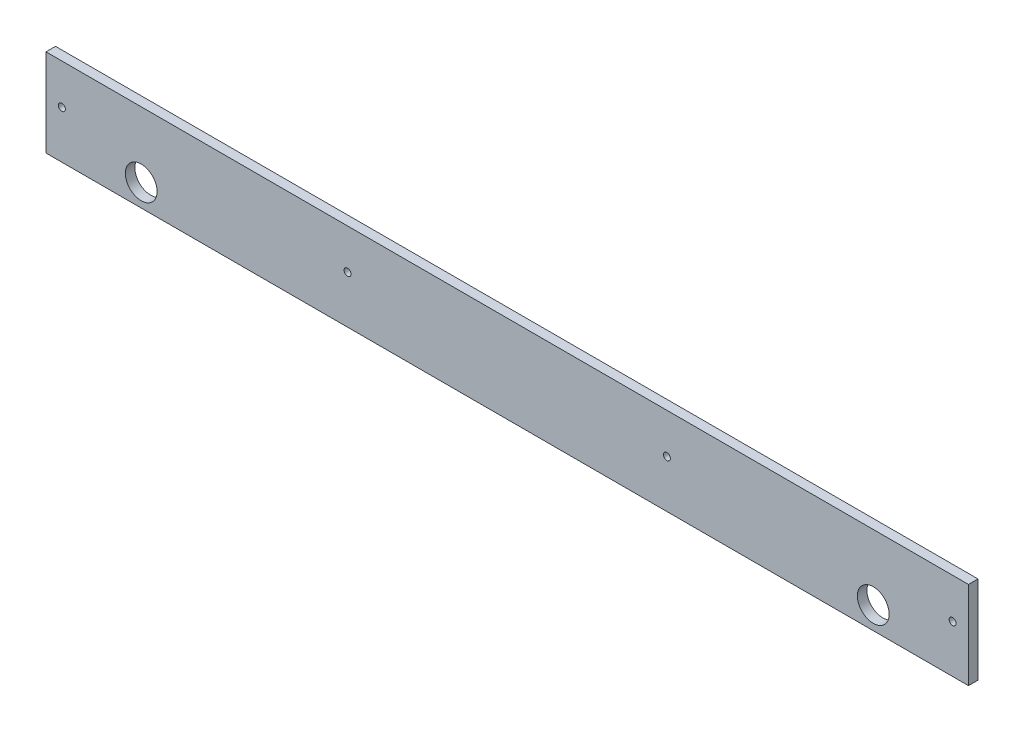
ISO-10303-21;
HEADER;
FILE_DESCRIPTION(('STEP AP214'),'2;1');
FILE_NAME('part.step','',(''),(''),'','','');
FILE_SCHEMA(('AUTOMOTIVE_DESIGN { 1 0 10303 214 1 1 1 1 }'));
ENDSEC;
DATA;
#1=APPLICATION_CONTEXT('core data for automotive mechanical design processes');
#2=APPLICATION_PROTOCOL_DEFINITION('international standard','automotive_design',2000,#1);
#3=PRODUCT_CONTEXT('',#1,'mechanical');
#4=PRODUCT('Part','Part','',(#3));
#5=PRODUCT_RELATED_PRODUCT_CATEGORY('part','',(#4));
#6=PRODUCT_DEFINITION_FORMATION('','',#4);
#7=PRODUCT_DEFINITION_CONTEXT('part definition',#1,'design');
#8=PRODUCT_DEFINITION('design','',#6,#7);
#9=PRODUCT_DEFINITION_SHAPE('','',#8);
#10=(LENGTH_UNIT() NAMED_UNIT(*) SI_UNIT(.MILLI.,.METRE.));
#11=(NAMED_UNIT(*) PLANE_ANGLE_UNIT() SI_UNIT($,.RADIAN.));
#12=(NAMED_UNIT(*) SI_UNIT($,.STERADIAN.) SOLID_ANGLE_UNIT());
#13=UNCERTAINTY_MEASURE_WITH_UNIT(LENGTH_MEASURE(1.E-05),#10,'distance_accuracy_value','');
#14=(GEOMETRIC_REPRESENTATION_CONTEXT(3) GLOBAL_UNCERTAINTY_ASSIGNED_CONTEXT((#13)) GLOBAL_UNIT_ASSIGNED_CONTEXT((#10,
#11,#12)) REPRESENTATION_CONTEXT('',''));
#15=CARTESIAN_POINT('',(0.,0.,0.));
#16=DIRECTION('',(0.,0.,1.));
#17=DIRECTION('',(1.,0.,0.));
#18=AXIS2_PLACEMENT_3D('',#15,#16,#17);
#19=CARTESIAN_POINT('',(-3.92699081749999,0.,3.));
#20=DIRECTION('',(0.,0.,1.));
#21=DIRECTION('',(1.,0.,0.));
#22=AXIS2_PLACEMENT_3D('',#19,#20,#21);
#23=PLANE('',#22);
#24=CARTESIAN_POINT('',(256.6703296775,7.,3.));
#25=DIRECTION('',(0.,0.,1.));
#26=DIRECTION('',(1.,0.,0.));
#27=AXIS2_PLACEMENT_3D('',#24,#25,#26);
#28=CIRCLE('',#27,4.99999999999999);
#29=CARTESIAN_POINT('',(261.6703296775,7.,3.));
#30=VERTEX_POINT('',#29);
#31=EDGE_CURVE('E142',#30,#30,#28,.T.);
#32=ORIENTED_EDGE('',*,*,#31,.F.);
#33=EDGE_LOOP('',(#32));
#34=FACE_BOUND('',#33,.T.);
#35=CARTESIAN_POINT('',(26.0730091825,7.,3.));
#36=DIRECTION('',(0.,0.,1.));
#37=DIRECTION('',(1.,0.,0.));
#38=AXIS2_PLACEMENT_3D('',#35,#36,#37);
#39=CIRCLE('',#38,5.);
#40=CARTESIAN_POINT('',(31.0730091825,7.,3.));
#41=VERTEX_POINT('',#40);
#42=EDGE_CURVE('E136',#41,#41,#39,.T.);
#43=ORIENTED_EDGE('',*,*,#42,.F.);
#44=EDGE_LOOP('',(#43));
#45=FACE_BOUND('',#44,.T.);
#46=CARTESIAN_POINT('',(191.6703296775,15.0000000000001,3.));
#47=DIRECTION('',(0.,0.,1.));
#48=DIRECTION('',(1.,0.,0.));
#49=AXIS2_PLACEMENT_3D('',#46,#47,#48);
#50=CIRCLE('',#49,1.09999999999999);
#51=CARTESIAN_POINT('',(192.7703296775,15.0000000000001,3.));
#52=VERTEX_POINT('',#51);
#53=EDGE_CURVE('E121',#52,#52,#50,.T.);
#54=ORIENTED_EDGE('',*,*,#53,.F.);
#55=EDGE_LOOP('',(#54));
#56=FACE_BOUND('',#55,.T.);
#57=CARTESIAN_POINT('',(91.0730091825,15.,3.));
#58=DIRECTION('',(0.,0.,1.));
#59=DIRECTION('',(1.,0.,0.));
#60=AXIS2_PLACEMENT_3D('',#57,#58,#59);
#61=CIRCLE('',#60,1.10000000000001);
#62=CARTESIAN_POINT('',(92.1730091825,15.,3.));
#63=VERTEX_POINT('',#62);
#64=EDGE_CURVE('E100',#63,#63,#61,.T.);
#65=ORIENTED_EDGE('',*,*,#64,.F.);
#66=EDGE_LOOP('',(#65));
#67=FACE_BOUND('',#66,.T.);
#68=DIRECTION('',(0.,-1.,0.));
#69=VECTOR('',#68,1.);
#70=CARTESIAN_POINT('',(-3.92699081749999,27.625,3.));
#71=LINE('',#70,#69);
#72=CARTESIAN_POINT('',(-3.92699081749999,27.625,3.));
#73=VERTEX_POINT('',#72);
#74=CARTESIAN_POINT('',(-3.92699081749999,0.,3.));
#75=VERTEX_POINT('',#74);
#76=EDGE_CURVE('E85',#73,#75,#71,.T.);
#77=ORIENTED_EDGE('',*,*,#76,.T.);
#78=DIRECTION('',(1.,0.,0.));
#79=VECTOR('',#78,1.);
#80=CARTESIAN_POINT('',(-3.92699081749999,0.,3.));
#81=LINE('',#80,#79);
#82=CARTESIAN_POINT('',(286.6703296775,0.,3.));
#83=VERTEX_POINT('',#82);
#84=EDGE_CURVE('E80',#75,#83,#81,.T.);
#85=ORIENTED_EDGE('',*,*,#84,.T.);
#86=DIRECTION('',(0.,1.,0.));
#87=VECTOR('',#86,1.);
#88=CARTESIAN_POINT('',(286.6703296775,27.625,3.));
#89=LINE('',#88,#87);
#90=CARTESIAN_POINT('',(286.6703296775,27.625,3.));
#91=VERTEX_POINT('',#90);
#92=EDGE_CURVE('E83',#83,#91,#89,.T.);
#93=ORIENTED_EDGE('',*,*,#92,.T.);
#94=DIRECTION('',(-1.,0.,0.));
#95=VECTOR('',#94,1.);
#96=CARTESIAN_POINT('',(-3.92699081749999,27.625,3.));
#97=LINE('',#96,#95);
#98=EDGE_CURVE('E50',#91,#73,#97,.T.);
#99=ORIENTED_EDGE('',*,*,#98,.T.);
#100=EDGE_LOOP('',(#77,#85,#93,#99));
#101=FACE_BOUND('',#100,.T.);
#102=CARTESIAN_POINT('',(1.07300918250001,15.,3.));
#103=DIRECTION('',(0.,0.,1.));
#104=DIRECTION('',(1.,0.,0.));
#105=AXIS2_PLACEMENT_3D('',#102,#103,#104);
#106=CIRCLE('',#105,1.1);
#107=CARTESIAN_POINT('',(2.17300918250001,15.,3.));
#108=VERTEX_POINT('',#107);
#109=EDGE_CURVE('E115',#108,#108,#106,.T.);
#110=ORIENTED_EDGE('',*,*,#109,.F.);
#111=EDGE_LOOP('',(#110));
#112=FACE_BOUND('',#111,.T.);
#113=CARTESIAN_POINT('',(281.6703296775,15.,3.));
#114=DIRECTION('',(0.,0.,1.));
#115=DIRECTION('',(1.,0.,0.));
#116=AXIS2_PLACEMENT_3D('',#113,#114,#115);
#117=CIRCLE('',#116,1.09999999999999);
#118=CARTESIAN_POINT('',(282.7703296775,15.,3.));
#119=VERTEX_POINT('',#118);
#120=EDGE_CURVE('E127',#119,#119,#117,.T.);
#121=ORIENTED_EDGE('',*,*,#120,.F.);
#122=EDGE_LOOP('',(#121));
#123=FACE_BOUND('',#122,.T.);
#124=ADVANCED_FACE('F33',(#34,#45,#56,#67,#101,#112,#123),#23,.T.);
#125=CARTESIAN_POINT('',(-3.92699081749999,0.,0.));
#126=DIRECTION('',(0.,0.,1.));
#127=DIRECTION('',(1.,0.,0.));
#128=AXIS2_PLACEMENT_3D('',#125,#126,#127);
#129=PLANE('',#128);
#130=CARTESIAN_POINT('',(256.6703296775,7.,0.));
#131=DIRECTION('',(0.,0.,1.));
#132=DIRECTION('',(1.,0.,0.));
#133=AXIS2_PLACEMENT_3D('',#130,#131,#132);
#134=CIRCLE('',#133,4.99999999999999);
#135=CARTESIAN_POINT('',(261.6703296775,7.,0.));
#136=VERTEX_POINT('',#135);
#137=EDGE_CURVE('E139',#136,#136,#134,.T.);
#138=ORIENTED_EDGE('',*,*,#137,.T.);
#139=EDGE_LOOP('',(#138));
#140=FACE_BOUND('',#139,.T.);
#141=CARTESIAN_POINT('',(26.0730091825,7.,0.));
#142=DIRECTION('',(0.,0.,1.));
#143=DIRECTION('',(1.,0.,0.));
#144=AXIS2_PLACEMENT_3D('',#141,#142,#143);
#145=CIRCLE('',#144,5.);
#146=CARTESIAN_POINT('',(31.0730091825,7.,0.));
#147=VERTEX_POINT('',#146);
#148=EDGE_CURVE('E133',#147,#147,#145,.T.);
#149=ORIENTED_EDGE('',*,*,#148,.T.);
#150=EDGE_LOOP('',(#149));
#151=FACE_BOUND('',#150,.T.);
#152=DIRECTION('',(0.,-1.,0.));
#153=VECTOR('',#152,1.);
#154=CARTESIAN_POINT('',(-3.92699081749999,27.625,0.));
#155=LINE('',#154,#153);
#156=CARTESIAN_POINT('',(-3.92699081749999,27.625,0.));
#157=VERTEX_POINT('',#156);
#158=CARTESIAN_POINT('',(-3.92699081749999,0.,0.));
#159=VERTEX_POINT('',#158);
#160=EDGE_CURVE('E97',#157,#159,#155,.T.);
#161=ORIENTED_EDGE('',*,*,#160,.F.);
#162=DIRECTION('',(-1.,0.,0.));
#163=VECTOR('',#162,1.);
#164=CARTESIAN_POINT('',(-3.92699081749999,27.625,0.));
#165=LINE('',#164,#163);
#166=CARTESIAN_POINT('',(286.6703296775,27.625,0.));
#167=VERTEX_POINT('',#166);
#168=EDGE_CURVE('E73',#167,#157,#165,.T.);
#169=ORIENTED_EDGE('',*,*,#168,.F.);
#170=DIRECTION('',(0.,1.,0.));
#171=VECTOR('',#170,1.);
#172=CARTESIAN_POINT('',(286.6703296775,27.625,0.));
#173=LINE('',#172,#171);
#174=CARTESIAN_POINT('',(286.6703296775,0.,0.));
#175=VERTEX_POINT('',#174);
#176=EDGE_CURVE('E67',#175,#167,#173,.T.);
#177=ORIENTED_EDGE('',*,*,#176,.F.);
#178=DIRECTION('',(1.,0.,0.));
#179=VECTOR('',#178,1.);
#180=CARTESIAN_POINT('',(-3.92699081749999,0.,0.));
#181=LINE('',#180,#179);
#182=EDGE_CURVE('E89',#159,#175,#181,.T.);
#183=ORIENTED_EDGE('',*,*,#182,.F.);
#184=EDGE_LOOP('',(#161,#169,#177,#183));
#185=FACE_BOUND('',#184,.T.);
#186=CARTESIAN_POINT('',(91.0730091825,15.,0.));
#187=DIRECTION('',(0.,0.,1.));
#188=DIRECTION('',(1.,0.,0.));
#189=AXIS2_PLACEMENT_3D('',#186,#187,#188);
#190=CIRCLE('',#189,1.10000000000001);
#191=CARTESIAN_POINT('',(92.1730091825,15.,0.));
#192=VERTEX_POINT('',#191);
#193=EDGE_CURVE('E112',#192,#192,#190,.T.);
#194=ORIENTED_EDGE('',*,*,#193,.T.);
#195=EDGE_LOOP('',(#194));
#196=FACE_BOUND('',#195,.T.);
#197=CARTESIAN_POINT('',(1.07300918250001,15.,0.));
#198=DIRECTION('',(0.,0.,1.));
#199=DIRECTION('',(1.,0.,0.));
#200=AXIS2_PLACEMENT_3D('',#197,#198,#199);
#201=CIRCLE('',#200,1.1);
#202=CARTESIAN_POINT('',(2.17300918250001,15.,0.));
#203=VERTEX_POINT('',#202);
#204=EDGE_CURVE('E118',#203,#203,#201,.T.);
#205=ORIENTED_EDGE('',*,*,#204,.T.);
#206=EDGE_LOOP('',(#205));
#207=FACE_BOUND('',#206,.T.);
#208=CARTESIAN_POINT('',(191.6703296775,15.0000000000001,0.));
#209=DIRECTION('',(0.,0.,1.));
#210=DIRECTION('',(1.,0.,0.));
#211=AXIS2_PLACEMENT_3D('',#208,#209,#210);
#212=CIRCLE('',#211,1.09999999999999);
#213=CARTESIAN_POINT('',(192.7703296775,15.0000000000001,0.));
#214=VERTEX_POINT('',#213);
#215=EDGE_CURVE('E124',#214,#214,#212,.T.);
#216=ORIENTED_EDGE('',*,*,#215,.T.);
#217=EDGE_LOOP('',(#216));
#218=FACE_BOUND('',#217,.T.);
#219=CARTESIAN_POINT('',(281.6703296775,15.,0.));
#220=DIRECTION('',(0.,0.,1.));
#221=DIRECTION('',(1.,0.,0.));
#222=AXIS2_PLACEMENT_3D('',#219,#220,#221);
#223=CIRCLE('',#222,1.09999999999999);
#224=CARTESIAN_POINT('',(282.7703296775,15.,0.));
#225=VERTEX_POINT('',#224);
#226=EDGE_CURVE('E130',#225,#225,#223,.T.);
#227=ORIENTED_EDGE('',*,*,#226,.T.);
#228=EDGE_LOOP('',(#227));
#229=FACE_BOUND('',#228,.T.);
#230=ADVANCED_FACE('F108',(#140,#151,#185,#196,#207,#218,#229),#129,.F.);
#231=CARTESIAN_POINT('',(-3.92699081749999,27.625,3.));
#232=DIRECTION('',(1.,0.,0.));
#233=DIRECTION('',(0.,0.,-1.));
#234=AXIS2_PLACEMENT_3D('',#231,#232,#233);
#235=PLANE('',#234);
#236=ORIENTED_EDGE('',*,*,#160,.T.);
#237=DIRECTION('',(0.,0.,-1.));
#238=VECTOR('',#237,1.);
#239=CARTESIAN_POINT('',(-3.92699081749999,0.,3.));
#240=LINE('',#239,#238);
#241=EDGE_CURVE('E11',#75,#159,#240,.T.);
#242=ORIENTED_EDGE('',*,*,#241,.F.);
#243=ORIENTED_EDGE('',*,*,#76,.F.);
#244=DIRECTION('',(0.,0.,-1.));
#245=VECTOR('',#244,1.);
#246=CARTESIAN_POINT('',(-3.92699081749999,27.625,3.));
#247=LINE('',#246,#245);
#248=EDGE_CURVE('E93',#73,#157,#247,.T.);
#249=ORIENTED_EDGE('',*,*,#248,.T.);
#250=EDGE_LOOP('',(#236,#242,#243,#249));
#251=FACE_BOUND('',#250,.T.);
#252=ADVANCED_FACE('F35',(#251),#235,.F.);
#253=CARTESIAN_POINT('',(-3.92699081749999,0.,3.));
#254=DIRECTION('',(0.,1.,0.));
#255=DIRECTION('',(0.,0.,1.));
#256=AXIS2_PLACEMENT_3D('',#253,#254,#255);
#257=PLANE('',#256);
#258=ORIENTED_EDGE('',*,*,#182,.T.);
#259=DIRECTION('',(0.,0.,-1.));
#260=VECTOR('',#259,1.);
#261=CARTESIAN_POINT('',(286.6703296775,0.,3.));
#262=LINE('',#261,#260);
#263=EDGE_CURVE('E42',#83,#175,#262,.T.);
#264=ORIENTED_EDGE('',*,*,#263,.F.);
#265=ORIENTED_EDGE('',*,*,#84,.F.);
#266=ORIENTED_EDGE('',*,*,#241,.T.);
#267=EDGE_LOOP('',(#258,#264,#265,#266));
#268=FACE_BOUND('',#267,.T.);
#269=ADVANCED_FACE('F88',(#268),#257,.F.);
#270=CARTESIAN_POINT('',(286.6703296775,27.625,3.));
#271=DIRECTION('',(-1.,0.,0.));
#272=DIRECTION('',(0.,0.,1.));
#273=AXIS2_PLACEMENT_3D('',#270,#271,#272);
#274=PLANE('',#273);
#275=ORIENTED_EDGE('',*,*,#176,.T.);
#276=DIRECTION('',(0.,0.,-1.));
#277=VECTOR('',#276,1.);
#278=CARTESIAN_POINT('',(286.6703296775,27.625,3.));
#279=LINE('',#278,#277);
#280=EDGE_CURVE('E90',#91,#167,#279,.T.);
#281=ORIENTED_EDGE('',*,*,#280,.F.);
#282=ORIENTED_EDGE('',*,*,#92,.F.);
#283=ORIENTED_EDGE('',*,*,#263,.T.);
#284=EDGE_LOOP('',(#275,#281,#282,#283));
#285=FACE_BOUND('',#284,.T.);
#286=ADVANCED_FACE('F91',(#285),#274,.F.);
#287=CARTESIAN_POINT('',(-3.92699081749999,27.625,3.));
#288=DIRECTION('',(0.,-1.,0.));
#289=DIRECTION('',(0.,0.,-1.));
#290=AXIS2_PLACEMENT_3D('',#287,#288,#289);
#291=PLANE('',#290);
#292=ORIENTED_EDGE('',*,*,#168,.T.);
#293=ORIENTED_EDGE('',*,*,#248,.F.);
#294=ORIENTED_EDGE('',*,*,#98,.F.);
#295=ORIENTED_EDGE('',*,*,#280,.T.);
#296=EDGE_LOOP('',(#292,#293,#294,#295));
#297=FACE_BOUND('',#296,.T.);
#298=ADVANCED_FACE('F105',(#297),#291,.F.);
#299=CARTESIAN_POINT('',(91.0730091825,15.,3.));
#300=DIRECTION('',(0.,0.,-1.));
#301=DIRECTION('',(-1.,0.,0.));
#302=AXIS2_PLACEMENT_3D('',#299,#300,#301);
#303=CYLINDRICAL_SURFACE('',#302,1.10000000000001);
#304=ORIENTED_EDGE('',*,*,#64,.T.);
#305=EDGE_LOOP('',(#304));
#306=FACE_BOUND('',#305,.T.);
#307=ORIENTED_EDGE('',*,*,#193,.F.);
#308=EDGE_LOOP('',(#307));
#309=FACE_BOUND('',#308,.T.);
#310=ADVANCED_FACE('F166',(#306,#309),#303,.F.);
#311=CARTESIAN_POINT('',(1.07300918250001,15.,3.));
#312=DIRECTION('',(0.,0.,-1.));
#313=DIRECTION('',(-1.,0.,0.));
#314=AXIS2_PLACEMENT_3D('',#311,#312,#313);
#315=CYLINDRICAL_SURFACE('',#314,1.1);
#316=ORIENTED_EDGE('',*,*,#109,.T.);
#317=EDGE_LOOP('',(#316));
#318=FACE_BOUND('',#317,.T.);
#319=ORIENTED_EDGE('',*,*,#204,.F.);
#320=EDGE_LOOP('',(#319));
#321=FACE_BOUND('',#320,.T.);
#322=ADVANCED_FACE('F169',(#318,#321),#315,.F.);
#323=CARTESIAN_POINT('',(191.6703296775,15.0000000000001,3.));
#324=DIRECTION('',(0.,0.,-1.));
#325=DIRECTION('',(-1.,0.,0.));
#326=AXIS2_PLACEMENT_3D('',#323,#324,#325);
#327=CYLINDRICAL_SURFACE('',#326,1.09999999999999);
#328=ORIENTED_EDGE('',*,*,#53,.T.);
#329=EDGE_LOOP('',(#328));
#330=FACE_BOUND('',#329,.T.);
#331=ORIENTED_EDGE('',*,*,#215,.F.);
#332=EDGE_LOOP('',(#331));
#333=FACE_BOUND('',#332,.T.);
#334=ADVANCED_FACE('F183',(#330,#333),#327,.F.);
#335=CARTESIAN_POINT('',(281.6703296775,15.,3.));
#336=DIRECTION('',(0.,0.,-1.));
#337=DIRECTION('',(-1.,0.,0.));
#338=AXIS2_PLACEMENT_3D('',#335,#336,#337);
#339=CYLINDRICAL_SURFACE('',#338,1.09999999999999);
#340=ORIENTED_EDGE('',*,*,#120,.T.);
#341=EDGE_LOOP('',(#340));
#342=FACE_BOUND('',#341,.T.);
#343=ORIENTED_EDGE('',*,*,#226,.F.);
#344=EDGE_LOOP('',(#343));
#345=FACE_BOUND('',#344,.T.);
#346=ADVANCED_FACE('F181',(#342,#345),#339,.F.);
#347=CARTESIAN_POINT('',(26.0730091825,7.,0.));
#348=DIRECTION('',(0.,0.,1.));
#349=DIRECTION('',(1.,0.,0.));
#350=AXIS2_PLACEMENT_3D('',#347,#348,#349);
#351=CYLINDRICAL_SURFACE('',#350,5.);
#352=ORIENTED_EDGE('',*,*,#148,.F.);
#353=EDGE_LOOP('',(#352));
#354=FACE_BOUND('',#353,.T.);
#355=ORIENTED_EDGE('',*,*,#42,.T.);
#356=EDGE_LOOP('',(#355));
#357=FACE_BOUND('',#356,.T.);
#358=ADVANCED_FACE('F153',(#354,#357),#351,.F.);
#359=CARTESIAN_POINT('',(256.6703296775,7.,0.));
#360=DIRECTION('',(0.,0.,1.));
#361=DIRECTION('',(1.,0.,0.));
#362=AXIS2_PLACEMENT_3D('',#359,#360,#361);
#363=CYLINDRICAL_SURFACE('',#362,4.99999999999999);
#364=ORIENTED_EDGE('',*,*,#137,.F.);
#365=EDGE_LOOP('',(#364));
#366=FACE_BOUND('',#365,.T.);
#367=ORIENTED_EDGE('',*,*,#31,.T.);
#368=EDGE_LOOP('',(#367));
#369=FACE_BOUND('',#368,.T.);
#370=ADVANCED_FACE('F150',(#366,#369),#363,.F.);
#371=CLOSED_SHELL('',(#124,#230,#252,#269,#286,#298,#310,#322,#334,#346,#358,#370));
#372=MANIFOLD_SOLID_BREP('B2',#371);
#373=ADVANCED_BREP_SHAPE_REPRESENTATION('',(#18,#372),#14);
#374=SHAPE_DEFINITION_REPRESENTATION(#9,#373);
ENDSEC;
END-ISO-10303-21;
